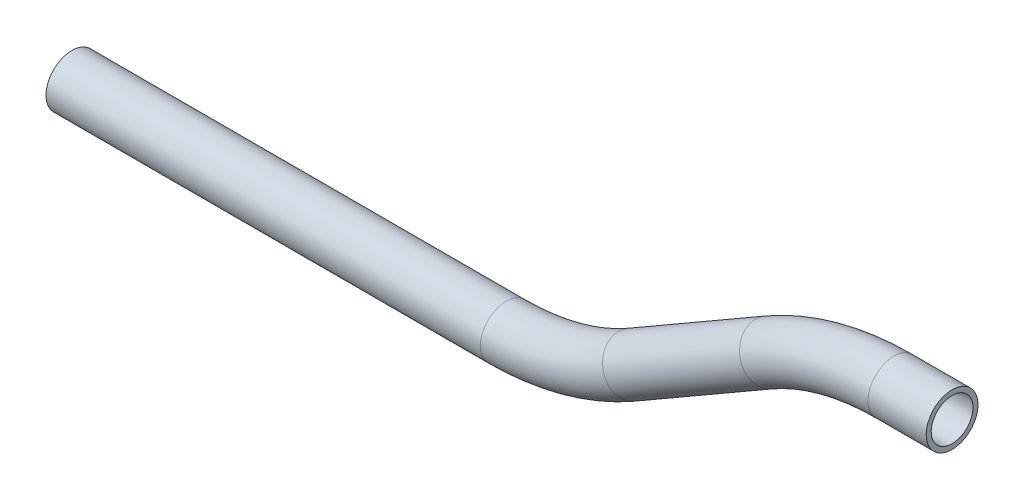
ISO-10303-21;
HEADER;
FILE_DESCRIPTION(('STEP AP214'),'2;1');
FILE_NAME('part.step','',(''),(''),'','','');
FILE_SCHEMA(('AUTOMOTIVE_DESIGN { 1 0 10303 214 1 1 1 1 }'));
ENDSEC;
DATA;
#1=APPLICATION_CONTEXT('core data for automotive mechanical design processes');
#2=APPLICATION_PROTOCOL_DEFINITION('international standard','automotive_design',2000,#1);
#3=PRODUCT_CONTEXT('',#1,'mechanical');
#4=PRODUCT('Part','Part','',(#3));
#5=PRODUCT_RELATED_PRODUCT_CATEGORY('part','',(#4));
#6=PRODUCT_DEFINITION_FORMATION('','',#4);
#7=PRODUCT_DEFINITION_CONTEXT('part definition',#1,'design');
#8=PRODUCT_DEFINITION('design','',#6,#7);
#9=PRODUCT_DEFINITION_SHAPE('','',#8);
#10=(LENGTH_UNIT() NAMED_UNIT(*) SI_UNIT(.MILLI.,.METRE.));
#11=(NAMED_UNIT(*) PLANE_ANGLE_UNIT() SI_UNIT($,.RADIAN.));
#12=(NAMED_UNIT(*) SI_UNIT($,.STERADIAN.) SOLID_ANGLE_UNIT());
#13=UNCERTAINTY_MEASURE_WITH_UNIT(LENGTH_MEASURE(1.E-05),#10,'distance_accuracy_value','');
#14=(GEOMETRIC_REPRESENTATION_CONTEXT(3) GLOBAL_UNCERTAINTY_ASSIGNED_CONTEXT((#13)) GLOBAL_UNIT_ASSIGNED_CONTEXT((#10,
#11,#12)) REPRESENTATION_CONTEXT('',''));
#15=CARTESIAN_POINT('',(0.,0.,0.));
#16=DIRECTION('',(0.,0.,1.));
#17=DIRECTION('',(1.,0.,0.));
#18=AXIS2_PLACEMENT_3D('',#15,#16,#17);
#19=CARTESIAN_POINT('',(45.2161884712732,15.1508063567214,0.));
#20=DIRECTION('',(-1.,0.,0.));
#21=DIRECTION('',(0.,-1.,0.));
#22=AXIS2_PLACEMENT_3D('',#19,#20,#21);
#23=CYLINDRICAL_SURFACE('',#22,7.874);
#24=CARTESIAN_POINT('',(27.5339169345249,15.1508063567214,0.));
#25=DIRECTION('',(-1.,0.,0.));
#26=DIRECTION('',(0.,-1.,0.));
#27=AXIS2_PLACEMENT_3D('',#24,#25,#26);
#28=CIRCLE('',#27,7.874);
#29=CARTESIAN_POINT('',(27.5339169345249,23.0248063567214,0.));
#30=VERTEX_POINT('',#29);
#31=EDGE_CURVE('E57',#30,#30,#28,.T.);
#32=ORIENTED_EDGE('',*,*,#31,.F.);
#33=EDGE_LOOP('',(#32));
#34=FACE_BOUND('',#33,.T.);
#35=CARTESIAN_POINT('',(45.2161884712732,15.1508063567214,0.));
#36=DIRECTION('',(-1.,0.,0.));
#37=DIRECTION('',(0.,-1.,0.));
#38=AXIS2_PLACEMENT_3D('',#35,#36,#37);
#39=CIRCLE('',#38,7.874);
#40=CARTESIAN_POINT('',(45.2161884712732,7.27680635672139,0.));
#41=VERTEX_POINT('',#40);
#42=EDGE_CURVE('E54',#41,#41,#39,.T.);
#43=ORIENTED_EDGE('',*,*,#42,.T.);
#44=EDGE_LOOP('',(#43));
#45=FACE_BOUND('',#44,.T.);
#46=ADVANCED_FACE('F33',(#34,#45),#23,.T.);
#47=CARTESIAN_POINT('',(27.5339169345249,-61.0491936432786,0.));
#48=DIRECTION('',(0.,0.,1.));
#49=DIRECTION('',(1.,0.,0.));
#50=AXIS2_PLACEMENT_3D('',#47,#48,#49);
#51=TOROIDAL_SURFACE('',#50,76.2,7.874);
#52=CARTESIAN_POINT('',(-10.5660830654752,4.94194212509554,0.));
#53=DIRECTION('',(-0.866025403784438,-0.500000000000001,0.));
#54=DIRECTION('',(0.500000000000001,-0.866025403784438,0.));
#55=AXIS2_PLACEMENT_3D('',#52,#53,#54);
#56=CIRCLE('',#55,7.874);
#57=CARTESIAN_POINT('',(-14.5030830654752,11.7610261544942,0.));
#58=VERTEX_POINT('',#57);
#59=EDGE_CURVE('E60',#58,#58,#56,.T.);
#60=CARTESIAN_POINT('',(27.5339169345249,-61.0491936432786,0.));
#61=DIRECTION('',(0.,0.,1.));
#62=DIRECTION('',(1.,0.,0.));
#63=AXIS2_PLACEMENT_3D('',#60,#61,#62);
#64=CIRCLE('',#63,84.074);
#65=EDGE_CURVE('',#30,#58,#64,.T.);
#66=ORIENTED_EDGE('',*,*,#31,.T.);
#67=ORIENTED_EDGE('',*,*,#59,.F.);
#68=ORIENTED_EDGE('',*,*,#65,.T.);
#69=ORIENTED_EDGE('',*,*,#65,.F.);
#70=EDGE_LOOP('',(#66,#68,#67,#69));
#71=FACE_BOUND('',#70,.T.);
#72=ADVANCED_FACE('F79',(#71),#51,.T.);
#73=CARTESIAN_POINT('',(-10.5660830654752,4.94194212509554,0.));
#74=DIRECTION('',(-0.866025403784436,-0.500000000000004,0.));
#75=DIRECTION('',(0.500000000000004,-0.866025403784436,0.));
#76=AXIS2_PLACEMENT_3D('',#73,#74,#75);
#77=CYLINDRICAL_SURFACE('',#76,7.874);
#78=CARTESIAN_POINT('',(-52.1911983884148,-19.0903294116531,0.));
#79=DIRECTION('',(-0.866025403784436,-0.500000000000004,0.));
#80=DIRECTION('',(0.500000000000004,-0.866025403784436,0.));
#81=AXIS2_PLACEMENT_3D('',#78,#79,#80);
#82=CIRCLE('',#81,7.874);
#83=CARTESIAN_POINT('',(-48.2541983884148,-25.9094134410518,0.));
#84=VERTEX_POINT('',#83);
#85=EDGE_CURVE('E62',#84,#84,#82,.T.);
#86=ORIENTED_EDGE('',*,*,#85,.F.);
#87=EDGE_LOOP('',(#86));
#88=FACE_BOUND('',#87,.T.);
#89=ORIENTED_EDGE('',*,*,#59,.T.);
#90=EDGE_LOOP('',(#89));
#91=FACE_BOUND('',#90,.T.);
#92=ADVANCED_FACE('F72',(#88,#91),#77,.T.);
#93=CARTESIAN_POINT('',(-90.2911983884149,46.9008063567211,0.));
#94=DIRECTION('',(0.,0.,-1.));
#95=DIRECTION('',(-1.,0.,0.));
#96=AXIS2_PLACEMENT_3D('',#93,#94,#95);
#97=TOROIDAL_SURFACE('',#96,76.2,7.874);
#98=CARTESIAN_POINT('',(-90.2911983884148,-29.299193643279,0.));
#99=DIRECTION('',(-1.,0.,0.));
#100=DIRECTION('',(0.,-1.,0.));
#101=AXIS2_PLACEMENT_3D('',#98,#99,#100);
#102=CIRCLE('',#101,7.874);
#103=CARTESIAN_POINT('',(-90.2911983884148,-37.1731936432789,0.));
#104=VERTEX_POINT('',#103);
#105=EDGE_CURVE('E37',#104,#104,#102,.T.);
#106=CARTESIAN_POINT('',(-90.2911983884149,46.9008063567211,0.));
#107=DIRECTION('',(0.,0.,-1.));
#108=DIRECTION('',(-1.,0.,0.));
#109=AXIS2_PLACEMENT_3D('',#106,#107,#108);
#110=CIRCLE('',#109,84.074);
#111=EDGE_CURVE('',#84,#104,#110,.T.);
#112=ORIENTED_EDGE('',*,*,#85,.T.);
#113=ORIENTED_EDGE('',*,*,#105,.F.);
#114=ORIENTED_EDGE('',*,*,#111,.T.);
#115=ORIENTED_EDGE('',*,*,#111,.F.);
#116=EDGE_LOOP('',(#112,#114,#113,#115));
#117=FACE_BOUND('',#116,.T.);
#118=ADVANCED_FACE('F70',(#117),#97,.T.);
#119=CARTESIAN_POINT('',(-90.2911983884148,-29.2991936432789,0.));
#120=DIRECTION('',(-1.,0.,0.));
#121=DIRECTION('',(0.,-1.,0.));
#122=AXIS2_PLACEMENT_3D('',#119,#120,#121);
#123=CYLINDRICAL_SURFACE('',#122,7.874);
#124=CARTESIAN_POINT('',(-222.273469925163,-29.2991936432789,0.));
#125=DIRECTION('',(-1.,0.,0.));
#126=DIRECTION('',(0.,-1.,0.));
#127=AXIS2_PLACEMENT_3D('',#124,#125,#126);
#128=CIRCLE('',#127,7.874);
#129=CARTESIAN_POINT('',(-222.273469925163,-37.1731936432789,0.));
#130=VERTEX_POINT('',#129);
#131=EDGE_CURVE('E50',#130,#130,#128,.T.);
#132=ORIENTED_EDGE('',*,*,#131,.F.);
#133=EDGE_LOOP('',(#132));
#134=FACE_BOUND('',#133,.T.);
#135=ORIENTED_EDGE('',*,*,#105,.T.);
#136=EDGE_LOOP('',(#135));
#137=FACE_BOUND('',#136,.T.);
#138=ADVANCED_FACE('F35',(#134,#137),#123,.T.);
#139=CARTESIAN_POINT('',(45.2161884712732,15.1508063567214,0.));
#140=DIRECTION('',(-1.,0.,0.));
#141=DIRECTION('',(0.,-1.,0.));
#142=AXIS2_PLACEMENT_3D('',#139,#140,#141);
#143=PLANE('',#142);
#144=CARTESIAN_POINT('',(45.2161884712732,15.1508063567214,0.));
#145=DIRECTION('',(-1.,0.,0.));
#146=DIRECTION('',(0.,-1.,0.));
#147=AXIS2_PLACEMENT_3D('',#144,#145,#146);
#148=CIRCLE('',#147,6.35);
#149=CARTESIAN_POINT('',(45.2161884712732,8.80080635672139,0.));
#150=VERTEX_POINT('',#149);
#151=EDGE_CURVE('E53',#150,#150,#148,.F.);
#152=ORIENTED_EDGE('',*,*,#151,.F.);
#153=EDGE_LOOP('',(#152));
#154=FACE_BOUND('',#153,.T.);
#155=ORIENTED_EDGE('',*,*,#42,.F.);
#156=EDGE_LOOP('',(#155));
#157=FACE_BOUND('',#156,.T.);
#158=ADVANCED_FACE('F77',(#154,#157),#143,.F.);
#159=CARTESIAN_POINT('',(-222.273469925163,-29.2991936432789,0.));
#160=DIRECTION('',(-1.,0.,0.));
#161=DIRECTION('',(0.,-1.,0.));
#162=AXIS2_PLACEMENT_3D('',#159,#160,#161);
#163=PLANE('',#162);
#164=CARTESIAN_POINT('',(-222.273469925163,-29.2991936432789,0.));
#165=DIRECTION('',(-1.,0.,0.));
#166=DIRECTION('',(0.,-1.,0.));
#167=AXIS2_PLACEMENT_3D('',#164,#165,#166);
#168=CIRCLE('',#167,6.35);
#169=CARTESIAN_POINT('',(-222.273469925163,-35.6491936432789,0.));
#170=VERTEX_POINT('',#169);
#171=EDGE_CURVE('E10',#170,#170,#168,.F.);
#172=ORIENTED_EDGE('',*,*,#171,.T.);
#173=EDGE_LOOP('',(#172));
#174=FACE_BOUND('',#173,.T.);
#175=ORIENTED_EDGE('',*,*,#131,.T.);
#176=EDGE_LOOP('',(#175));
#177=FACE_BOUND('',#176,.T.);
#178=ADVANCED_FACE('F96',(#174,#177),#163,.T.);
#179=CARTESIAN_POINT('',(45.2161884712732,15.1508063567214,0.));
#180=DIRECTION('',(-1.,0.,0.));
#181=DIRECTION('',(0.,-1.,0.));
#182=AXIS2_PLACEMENT_3D('',#179,#180,#181);
#183=CYLINDRICAL_SURFACE('',#182,6.35);
#184=CARTESIAN_POINT('',(27.5339169345249,15.1508063567214,0.));
#185=DIRECTION('',(-1.,0.,0.));
#186=DIRECTION('',(0.,-1.,0.));
#187=AXIS2_PLACEMENT_3D('',#184,#185,#186);
#188=CIRCLE('',#187,6.35);
#189=CARTESIAN_POINT('',(27.5339169345249,21.5008063567214,0.));
#190=VERTEX_POINT('',#189);
#191=EDGE_CURVE('E192',#190,#190,#188,.F.);
#192=ORIENTED_EDGE('',*,*,#191,.F.);
#193=EDGE_LOOP('',(#192));
#194=FACE_BOUND('',#193,.T.);
#195=ORIENTED_EDGE('',*,*,#151,.T.);
#196=EDGE_LOOP('',(#195));
#197=FACE_BOUND('',#196,.T.);
#198=ADVANCED_FACE('F99',(#194,#197),#183,.F.);
#199=CARTESIAN_POINT('',(27.5339169345249,-61.0491936432786,0.));
#200=DIRECTION('',(0.,0.,1.));
#201=DIRECTION('',(1.,0.,0.));
#202=AXIS2_PLACEMENT_3D('',#199,#200,#201);
#203=TOROIDAL_SURFACE('',#202,76.2,6.35);
#204=CARTESIAN_POINT('',(-10.5660830654752,4.94194212509554,0.));
#205=DIRECTION('',(-0.866025403784438,-0.500000000000001,0.));
#206=DIRECTION('',(0.500000000000001,-0.866025403784438,0.));
#207=AXIS2_PLACEMENT_3D('',#204,#205,#206);
#208=CIRCLE('',#207,6.35);
#209=CARTESIAN_POINT('',(-13.7410830654752,10.4412034391267,0.));
#210=VERTEX_POINT('',#209);
#211=EDGE_CURVE('E191',#210,#210,#208,.F.);
#212=CARTESIAN_POINT('',(27.5339169345249,-61.0491936432786,0.));
#213=DIRECTION('',(0.,0.,1.));
#214=DIRECTION('',(1.,0.,0.));
#215=AXIS2_PLACEMENT_3D('',#212,#213,#214);
#216=CIRCLE('',#215,82.55);
#217=EDGE_CURVE('',#190,#210,#216,.T.);
#218=ORIENTED_EDGE('',*,*,#191,.T.);
#219=ORIENTED_EDGE('',*,*,#211,.F.);
#220=ORIENTED_EDGE('',*,*,#217,.T.);
#221=ORIENTED_EDGE('',*,*,#217,.F.);
#222=EDGE_LOOP('',(#218,#220,#219,#221));
#223=FACE_BOUND('',#222,.T.);
#224=ADVANCED_FACE('F154',(#223),#203,.F.);
#225=CARTESIAN_POINT('',(-10.5660830654752,4.94194212509554,0.));
#226=DIRECTION('',(-0.866025403784436,-0.500000000000004,0.));
#227=DIRECTION('',(0.500000000000004,-0.866025403784436,0.));
#228=AXIS2_PLACEMENT_3D('',#225,#226,#227);
#229=CYLINDRICAL_SURFACE('',#228,6.35);
#230=CARTESIAN_POINT('',(-52.1911983884148,-19.0903294116531,0.));
#231=DIRECTION('',(-0.866025403784436,-0.500000000000004,0.));
#232=DIRECTION('',(0.500000000000004,-0.866025403784436,0.));
#233=AXIS2_PLACEMENT_3D('',#230,#231,#232);
#234=CIRCLE('',#233,6.35);
#235=CARTESIAN_POINT('',(-49.0161983884148,-24.5895907256843,0.));
#236=VERTEX_POINT('',#235);
#237=EDGE_CURVE('E46',#236,#236,#234,.F.);
#238=ORIENTED_EDGE('',*,*,#237,.F.);
#239=EDGE_LOOP('',(#238));
#240=FACE_BOUND('',#239,.T.);
#241=ORIENTED_EDGE('',*,*,#211,.T.);
#242=EDGE_LOOP('',(#241));
#243=FACE_BOUND('',#242,.T.);
#244=ADVANCED_FACE('F90',(#240,#243),#229,.F.);
#245=CARTESIAN_POINT('',(-90.2911983884149,46.9008063567211,0.));
#246=DIRECTION('',(0.,0.,-1.));
#247=DIRECTION('',(-1.,0.,0.));
#248=AXIS2_PLACEMENT_3D('',#245,#246,#247);
#249=TOROIDAL_SURFACE('',#248,76.2,6.35);
#250=CARTESIAN_POINT('',(-90.2911983884148,-29.299193643279,0.));
#251=DIRECTION('',(-1.,0.,0.));
#252=DIRECTION('',(0.,-1.,0.));
#253=AXIS2_PLACEMENT_3D('',#250,#251,#252);
#254=CIRCLE('',#253,6.35);
#255=CARTESIAN_POINT('',(-90.2911983884148,-35.6491936432789,0.));
#256=VERTEX_POINT('',#255);
#257=EDGE_CURVE('E41',#256,#256,#254,.F.);
#258=CARTESIAN_POINT('',(-90.2911983884149,46.9008063567211,0.));
#259=DIRECTION('',(0.,0.,-1.));
#260=DIRECTION('',(-1.,0.,0.));
#261=AXIS2_PLACEMENT_3D('',#258,#259,#260);
#262=CIRCLE('',#261,82.55);
#263=EDGE_CURVE('',#236,#256,#262,.T.);
#264=ORIENTED_EDGE('',*,*,#237,.T.);
#265=ORIENTED_EDGE('',*,*,#257,.F.);
#266=ORIENTED_EDGE('',*,*,#263,.T.);
#267=ORIENTED_EDGE('',*,*,#263,.F.);
#268=EDGE_LOOP('',(#264,#266,#265,#267));
#269=FACE_BOUND('',#268,.T.);
#270=ADVANCED_FACE('F84',(#269),#249,.F.);
#271=CARTESIAN_POINT('',(-90.2911983884148,-29.2991936432789,0.));
#272=DIRECTION('',(-1.,0.,0.));
#273=DIRECTION('',(0.,-1.,0.));
#274=AXIS2_PLACEMENT_3D('',#271,#272,#273);
#275=CYLINDRICAL_SURFACE('',#274,6.35);
#276=ORIENTED_EDGE('',*,*,#171,.F.);
#277=EDGE_LOOP('',(#276));
#278=FACE_BOUND('',#277,.T.);
#279=ORIENTED_EDGE('',*,*,#257,.T.);
#280=EDGE_LOOP('',(#279));
#281=FACE_BOUND('',#280,.T.);
#282=ADVANCED_FACE('F82',(#278,#281),#275,.F.);
#283=CLOSED_SHELL('',(#46,#72,#92,#118,#138,#158,#178,#198,#224,#244,#270,#282));
#284=MANIFOLD_SOLID_BREP('B2',#283);
#285=ADVANCED_BREP_SHAPE_REPRESENTATION('',(#18,#284),#14);
#286=SHAPE_DEFINITION_REPRESENTATION(#9,#285);
ENDSEC;
END-ISO-10303-21;
